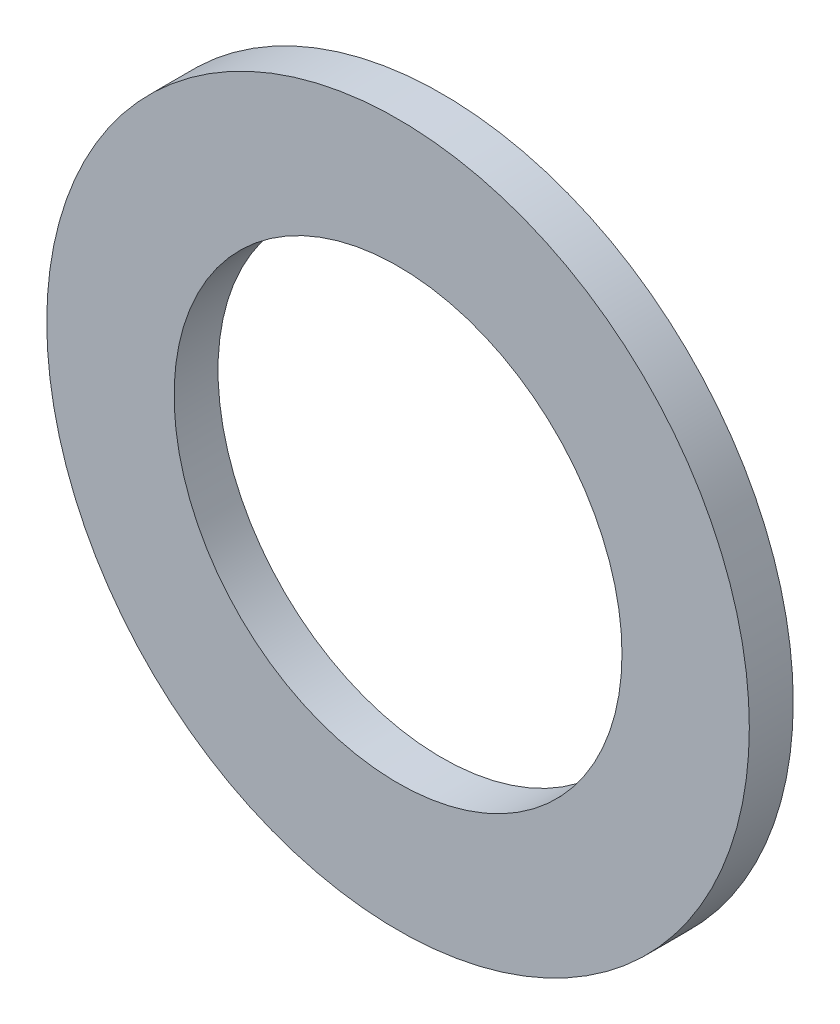
ISO-10303-21;
HEADER;
FILE_DESCRIPTION(('STEP AP214'),'2;1');
FILE_NAME('part.step','',(''),(''),'','','');
FILE_SCHEMA(('AUTOMOTIVE_DESIGN { 1 0 10303 214 1 1 1 1 }'));
ENDSEC;
DATA;
#1=APPLICATION_CONTEXT('core data for automotive mechanical design processes');
#2=APPLICATION_PROTOCOL_DEFINITION('international standard','automotive_design',2000,#1);
#3=PRODUCT_CONTEXT('',#1,'mechanical');
#4=PRODUCT('Part','Part','',(#3));
#5=PRODUCT_RELATED_PRODUCT_CATEGORY('part','',(#4));
#6=PRODUCT_DEFINITION_FORMATION('','',#4);
#7=PRODUCT_DEFINITION_CONTEXT('part definition',#1,'design');
#8=PRODUCT_DEFINITION('design','',#6,#7);
#9=PRODUCT_DEFINITION_SHAPE('','',#8);
#10=(LENGTH_UNIT() NAMED_UNIT(*) SI_UNIT(.MILLI.,.METRE.));
#11=(NAMED_UNIT(*) PLANE_ANGLE_UNIT() SI_UNIT($,.RADIAN.));
#12=(NAMED_UNIT(*) SI_UNIT($,.STERADIAN.) SOLID_ANGLE_UNIT());
#13=UNCERTAINTY_MEASURE_WITH_UNIT(LENGTH_MEASURE(1.E-05),#10,'distance_accuracy_value','');
#14=(GEOMETRIC_REPRESENTATION_CONTEXT(3) GLOBAL_UNCERTAINTY_ASSIGNED_CONTEXT((#13)) GLOBAL_UNIT_ASSIGNED_CONTEXT((#10,
#11,#12)) REPRESENTATION_CONTEXT('',''));
#15=CARTESIAN_POINT('',(0.,0.,0.));
#16=DIRECTION('',(0.,0.,1.));
#17=DIRECTION('',(1.,0.,0.));
#18=AXIS2_PLACEMENT_3D('',#15,#16,#17);
#19=CARTESIAN_POINT('',(0.,0.,0.25));
#20=DIRECTION('',(0.,0.,1.));
#21=DIRECTION('',(1.,0.,0.));
#22=AXIS2_PLACEMENT_3D('',#19,#20,#21);
#23=PLANE('',#22);
#24=CARTESIAN_POINT('',(0.,0.,0.25));
#25=DIRECTION('',(0.,0.,1.));
#26=DIRECTION('',(1.,0.,0.));
#27=AXIS2_PLACEMENT_3D('',#24,#25,#26);
#28=CIRCLE('',#27,4.);
#29=CARTESIAN_POINT('',(4.,0.,0.25));
#30=VERTEX_POINT('',#29);
#31=EDGE_CURVE('E10',#30,#30,#28,.T.);
#32=ORIENTED_EDGE('',*,*,#31,.T.);
#33=EDGE_LOOP('',(#32));
#34=FACE_BOUND('',#33,.T.);
#35=CARTESIAN_POINT('',(0.,0.,0.25));
#36=DIRECTION('',(0.,0.,1.));
#37=DIRECTION('',(1.,0.,0.));
#38=AXIS2_PLACEMENT_3D('',#35,#36,#37);
#39=CIRCLE('',#38,2.55);
#40=CARTESIAN_POINT('',(2.55,0.,0.25));
#41=VERTEX_POINT('',#40);
#42=EDGE_CURVE('E25',#41,#41,#39,.T.);
#43=ORIENTED_EDGE('',*,*,#42,.F.);
#44=EDGE_LOOP('',(#43));
#45=FACE_BOUND('',#44,.T.);
#46=ADVANCED_FACE('F14',(#34,#45),#23,.T.);
#47=CARTESIAN_POINT('',(0.,0.,-0.25));
#48=DIRECTION('',(0.,0.,1.));
#49=DIRECTION('',(1.,0.,0.));
#50=AXIS2_PLACEMENT_3D('',#47,#48,#49);
#51=PLANE('',#50);
#52=CARTESIAN_POINT('',(0.,0.,-0.25));
#53=DIRECTION('',(0.,0.,1.));
#54=DIRECTION('',(1.,0.,0.));
#55=AXIS2_PLACEMENT_3D('',#52,#53,#54);
#56=CIRCLE('',#55,4.);
#57=CARTESIAN_POINT('',(4.,0.,-0.25));
#58=VERTEX_POINT('',#57);
#59=EDGE_CURVE('E18',#58,#58,#56,.T.);
#60=ORIENTED_EDGE('',*,*,#59,.F.);
#61=EDGE_LOOP('',(#60));
#62=FACE_BOUND('',#61,.T.);
#63=CARTESIAN_POINT('',(0.,0.,-0.25));
#64=DIRECTION('',(0.,0.,1.));
#65=DIRECTION('',(1.,0.,0.));
#66=AXIS2_PLACEMENT_3D('',#63,#64,#65);
#67=CIRCLE('',#66,2.55);
#68=CARTESIAN_POINT('',(2.55,0.,-0.25));
#69=VERTEX_POINT('',#68);
#70=EDGE_CURVE('E27',#69,#69,#67,.T.);
#71=ORIENTED_EDGE('',*,*,#70,.T.);
#72=EDGE_LOOP('',(#71));
#73=FACE_BOUND('',#72,.T.);
#74=ADVANCED_FACE('F37',(#62,#73),#51,.F.);
#75=CARTESIAN_POINT('',(0.,0.,0.25));
#76=DIRECTION('',(0.,0.,-1.));
#77=DIRECTION('',(-1.,0.,0.));
#78=AXIS2_PLACEMENT_3D('',#75,#76,#77);
#79=CYLINDRICAL_SURFACE('',#78,4.);
#80=ORIENTED_EDGE('',*,*,#31,.F.);
#81=EDGE_LOOP('',(#80));
#82=FACE_BOUND('',#81,.T.);
#83=ORIENTED_EDGE('',*,*,#59,.T.);
#84=EDGE_LOOP('',(#83));
#85=FACE_BOUND('',#84,.T.);
#86=ADVANCED_FACE('F16',(#82,#85),#79,.T.);
#87=CARTESIAN_POINT('',(0.,0.,0.25));
#88=DIRECTION('',(0.,0.,-1.));
#89=DIRECTION('',(-1.,0.,0.));
#90=AXIS2_PLACEMENT_3D('',#87,#88,#89);
#91=CYLINDRICAL_SURFACE('',#90,2.55);
#92=ORIENTED_EDGE('',*,*,#42,.T.);
#93=EDGE_LOOP('',(#92));
#94=FACE_BOUND('',#93,.T.);
#95=ORIENTED_EDGE('',*,*,#70,.F.);
#96=EDGE_LOOP('',(#95));
#97=FACE_BOUND('',#96,.T.);
#98=ADVANCED_FACE('F33',(#94,#97),#91,.F.);
#99=CLOSED_SHELL('',(#46,#74,#86,#98));
#100=MANIFOLD_SOLID_BREP('B1',#99);
#101=ADVANCED_BREP_SHAPE_REPRESENTATION('',(#18,#100),#14);
#102=SHAPE_DEFINITION_REPRESENTATION(#9,#101);
ENDSEC;
END-ISO-10303-21;
